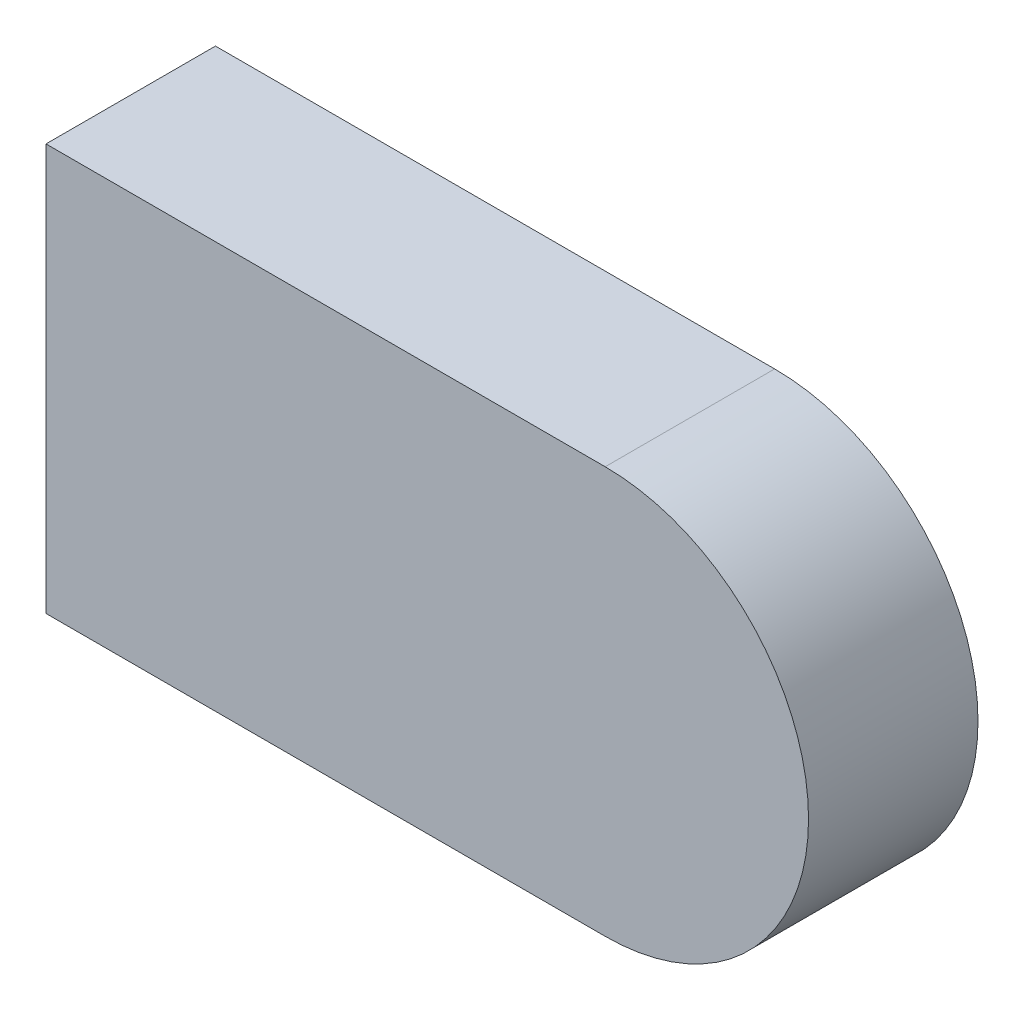
ISO-10303-21;
HEADER;
FILE_DESCRIPTION(('STEP AP214'),'2;1');
FILE_NAME('part.step','',(''),(''),'','','');
FILE_SCHEMA(('AUTOMOTIVE_DESIGN { 1 0 10303 214 1 1 1 1 }'));
ENDSEC;
DATA;
#1=APPLICATION_CONTEXT('core data for automotive mechanical design processes');
#2=APPLICATION_PROTOCOL_DEFINITION('international standard','automotive_design',2000,#1);
#3=PRODUCT_CONTEXT('',#1,'mechanical');
#4=PRODUCT('Part','Part','',(#3));
#5=PRODUCT_RELATED_PRODUCT_CATEGORY('part','',(#4));
#6=PRODUCT_DEFINITION_FORMATION('','',#4);
#7=PRODUCT_DEFINITION_CONTEXT('part definition',#1,'design');
#8=PRODUCT_DEFINITION('design','',#6,#7);
#9=PRODUCT_DEFINITION_SHAPE('','',#8);
#10=(LENGTH_UNIT() NAMED_UNIT(*) SI_UNIT(.MILLI.,.METRE.));
#11=(NAMED_UNIT(*) PLANE_ANGLE_UNIT() SI_UNIT($,.RADIAN.));
#12=(NAMED_UNIT(*) SI_UNIT($,.STERADIAN.) SOLID_ANGLE_UNIT());
#13=UNCERTAINTY_MEASURE_WITH_UNIT(LENGTH_MEASURE(1.E-05),#10,'distance_accuracy_value','');
#14=(GEOMETRIC_REPRESENTATION_CONTEXT(3) GLOBAL_UNCERTAINTY_ASSIGNED_CONTEXT((#13)) GLOBAL_UNIT_ASSIGNED_CONTEXT((#10,
#11,#12)) REPRESENTATION_CONTEXT('',''));
#15=CARTESIAN_POINT('',(0.,0.,0.));
#16=DIRECTION('',(0.,0.,1.));
#17=DIRECTION('',(1.,0.,0.));
#18=AXIS2_PLACEMENT_3D('',#15,#16,#17);
#19=CARTESIAN_POINT('',(-4.05,-2.87,0.));
#20=DIRECTION('',(0.,1.,0.));
#21=DIRECTION('',(1.,0.,0.));
#22=AXIS2_PLACEMENT_3D('',#19,#20,#21);
#23=PLANE('',#22);
#24=DIRECTION('',(1.,0.,0.));
#25=VECTOR('',#24,1.);
#26=CARTESIAN_POINT('',(-4.05,-2.87,0.));
#27=LINE('',#26,#25);
#28=CARTESIAN_POINT('',(-4.05,-2.87,0.));
#29=VERTEX_POINT('',#28);
#30=CARTESIAN_POINT('',(-3.72,-2.87,0.));
#31=VERTEX_POINT('',#30);
#32=EDGE_CURVE('E11',#29,#31,#27,.T.);
#33=ORIENTED_EDGE('',*,*,#32,.T.);
#34=DIRECTION('',(0.,0.,1.));
#35=VECTOR('',#34,1.);
#36=CARTESIAN_POINT('',(-3.72,-2.87,0.));
#37=LINE('',#36,#35);
#38=CARTESIAN_POINT('',(-3.72,-2.87,0.1));
#39=VERTEX_POINT('',#38);
#40=EDGE_CURVE('E24',#31,#39,#37,.T.);
#41=ORIENTED_EDGE('',*,*,#40,.T.);
#42=DIRECTION('',(1.,0.,0.));
#43=VECTOR('',#42,1.);
#44=CARTESIAN_POINT('',(-4.05,-2.87,0.1));
#45=LINE('',#44,#43);
#46=CARTESIAN_POINT('',(-4.05,-2.87,0.1));
#47=VERTEX_POINT('',#46);
#48=EDGE_CURVE('E88',#47,#39,#45,.T.);
#49=ORIENTED_EDGE('',*,*,#48,.F.);
#50=DIRECTION('',(0.,0.,1.));
#51=VECTOR('',#50,1.);
#52=CARTESIAN_POINT('',(-4.05,-2.87,0.));
#53=LINE('',#52,#51);
#54=EDGE_CURVE('E36',#29,#47,#53,.T.);
#55=ORIENTED_EDGE('',*,*,#54,.F.);
#56=EDGE_LOOP('',(#33,#41,#49,#55));
#57=FACE_BOUND('',#56,.T.);
#58=ADVANCED_FACE('F17',(#57),#23,.F.);
#59=CARTESIAN_POINT('',(-3.72,-2.75,0.));
#60=DIRECTION('',(0.,0.,-1.));
#61=DIRECTION('',(1.,0.,0.));
#62=AXIS2_PLACEMENT_3D('',#59,#60,#61);
#63=CYLINDRICAL_SURFACE('',#62,0.12);
#64=CARTESIAN_POINT('',(-3.72,-2.75,0.));
#65=DIRECTION('',(0.,0.,1.));
#66=DIRECTION('',(1.,0.,0.));
#67=AXIS2_PLACEMENT_3D('',#64,#65,#66);
#68=CIRCLE('',#67,0.12);
#69=CARTESIAN_POINT('',(-3.72,-2.63,0.));
#70=VERTEX_POINT('',#69);
#71=EDGE_CURVE('E85',#31,#70,#68,.T.);
#72=ORIENTED_EDGE('',*,*,#71,.T.);
#73=DIRECTION('',(0.,0.,1.));
#74=VECTOR('',#73,1.);
#75=CARTESIAN_POINT('',(-3.72,-2.63,0.));
#76=LINE('',#75,#74);
#77=CARTESIAN_POINT('',(-3.72,-2.63,0.1));
#78=VERTEX_POINT('',#77);
#79=EDGE_CURVE('E73',#70,#78,#76,.T.);
#80=ORIENTED_EDGE('',*,*,#79,.T.);
#81=CARTESIAN_POINT('',(-3.72,-2.75,0.1));
#82=DIRECTION('',(0.,0.,1.));
#83=DIRECTION('',(1.,0.,0.));
#84=AXIS2_PLACEMENT_3D('',#81,#82,#83);
#85=CIRCLE('',#84,0.12);
#86=EDGE_CURVE('E66',#39,#78,#85,.T.);
#87=ORIENTED_EDGE('',*,*,#86,.F.);
#88=ORIENTED_EDGE('',*,*,#40,.F.);
#89=EDGE_LOOP('',(#72,#80,#87,#88));
#90=FACE_BOUND('',#89,.T.);
#91=ADVANCED_FACE('F89',(#90),#63,.T.);
#92=CARTESIAN_POINT('',(-4.05,-2.63,0.));
#93=DIRECTION('',(0.,1.,0.));
#94=DIRECTION('',(1.,0.,0.));
#95=AXIS2_PLACEMENT_3D('',#92,#93,#94);
#96=PLANE('',#95);
#97=DIRECTION('',(0.,0.,1.));
#98=VECTOR('',#97,1.);
#99=CARTESIAN_POINT('',(-4.05,-2.63,0.));
#100=LINE('',#99,#98);
#101=CARTESIAN_POINT('',(-4.05,-2.63,0.));
#102=VERTEX_POINT('',#101);
#103=CARTESIAN_POINT('',(-4.05,-2.63,0.1));
#104=VERTEX_POINT('',#103);
#105=EDGE_CURVE('E56',#102,#104,#100,.T.);
#106=ORIENTED_EDGE('',*,*,#105,.T.);
#107=DIRECTION('',(1.,0.,0.));
#108=VECTOR('',#107,1.);
#109=CARTESIAN_POINT('',(-4.05,-2.63,0.1));
#110=LINE('',#109,#108);
#111=EDGE_CURVE('E67',#104,#78,#110,.T.);
#112=ORIENTED_EDGE('',*,*,#111,.T.);
#113=ORIENTED_EDGE('',*,*,#79,.F.);
#114=DIRECTION('',(1.,0.,0.));
#115=VECTOR('',#114,1.);
#116=CARTESIAN_POINT('',(-4.05,-2.63,0.));
#117=LINE('',#116,#115);
#118=EDGE_CURVE('E71',#102,#70,#117,.T.);
#119=ORIENTED_EDGE('',*,*,#118,.F.);
#120=EDGE_LOOP('',(#106,#112,#113,#119));
#121=FACE_BOUND('',#120,.T.);
#122=ADVANCED_FACE('F72',(#121),#96,.T.);
#123=CARTESIAN_POINT('',(-4.05,-2.87,0.));
#124=DIRECTION('',(-1.,0.,0.));
#125=DIRECTION('',(0.,1.,0.));
#126=AXIS2_PLACEMENT_3D('',#123,#124,#125);
#127=PLANE('',#126);
#128=ORIENTED_EDGE('',*,*,#54,.T.);
#129=DIRECTION('',(0.,1.,0.));
#130=VECTOR('',#129,1.);
#131=CARTESIAN_POINT('',(-4.05,-2.87,0.1));
#132=LINE('',#131,#130);
#133=EDGE_CURVE('E62',#47,#104,#132,.T.);
#134=ORIENTED_EDGE('',*,*,#133,.T.);
#135=ORIENTED_EDGE('',*,*,#105,.F.);
#136=DIRECTION('',(0.,1.,0.));
#137=VECTOR('',#136,1.);
#138=CARTESIAN_POINT('',(-4.05,-2.87,0.));
#139=LINE('',#138,#137);
#140=EDGE_CURVE('E60',#29,#102,#139,.T.);
#141=ORIENTED_EDGE('',*,*,#140,.F.);
#142=EDGE_LOOP('',(#128,#134,#135,#141));
#143=FACE_BOUND('',#142,.T.);
#144=ADVANCED_FACE('F58',(#143),#127,.T.);
#145=CARTESIAN_POINT('',(-3.849490847913,-2.75,0.));
#146=DIRECTION('',(0.,0.,1.));
#147=DIRECTION('',(1.,0.,0.));
#148=AXIS2_PLACEMENT_3D('',#145,#146,#147);
#149=PLANE('',#148);
#150=ORIENTED_EDGE('',*,*,#140,.T.);
#151=ORIENTED_EDGE('',*,*,#118,.T.);
#152=ORIENTED_EDGE('',*,*,#71,.F.);
#153=ORIENTED_EDGE('',*,*,#32,.F.);
#154=EDGE_LOOP('',(#150,#151,#152,#153));
#155=FACE_BOUND('',#154,.T.);
#156=ADVANCED_FACE('F77',(#155),#149,.F.);
#157=CARTESIAN_POINT('',(-3.849490847913,-2.75,0.1));
#158=DIRECTION('',(0.,0.,1.));
#159=DIRECTION('',(1.,0.,0.));
#160=AXIS2_PLACEMENT_3D('',#157,#158,#159);
#161=PLANE('',#160);
#162=ORIENTED_EDGE('',*,*,#48,.T.);
#163=ORIENTED_EDGE('',*,*,#86,.T.);
#164=ORIENTED_EDGE('',*,*,#111,.F.);
#165=ORIENTED_EDGE('',*,*,#133,.F.);
#166=EDGE_LOOP('',(#162,#163,#164,#165));
#167=FACE_BOUND('',#166,.T.);
#168=ADVANCED_FACE('F91',(#167),#161,.T.);
#169=CLOSED_SHELL('',(#58,#91,#122,#144,#156,#168));
#170=MANIFOLD_SOLID_BREP('B1',#169);
#171=ADVANCED_BREP_SHAPE_REPRESENTATION('',(#18,#170),#14);
#172=SHAPE_DEFINITION_REPRESENTATION(#9,#171);
ENDSEC;
END-ISO-10303-21;
